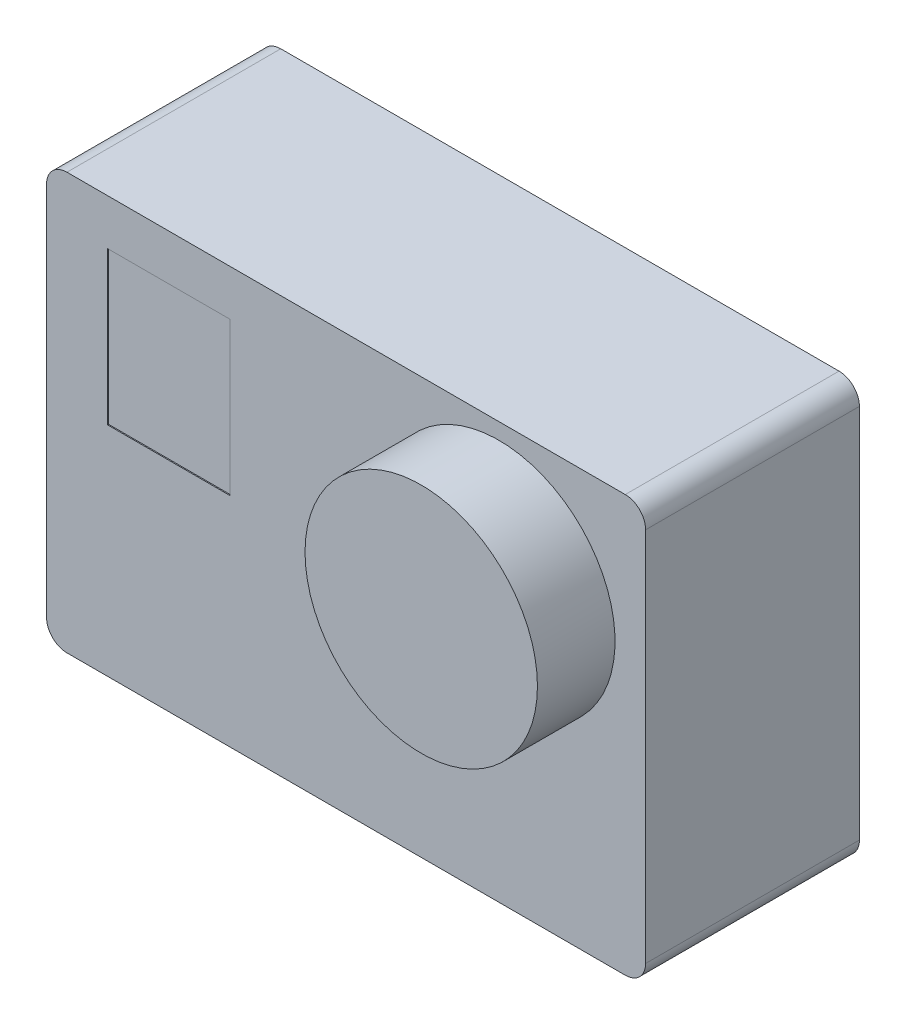
ISO-10303-21;
HEADER;
FILE_DESCRIPTION(('STEP AP214'),'2;1');
FILE_NAME('part.step','',(''),(''),'','','');
FILE_SCHEMA(('AUTOMOTIVE_DESIGN { 1 0 10303 214 1 1 1 1 }'));
ENDSEC;
DATA;
#1=APPLICATION_CONTEXT('core data for automotive mechanical design processes');
#2=APPLICATION_PROTOCOL_DEFINITION('international standard','automotive_design',2000,#1);
#3=PRODUCT_CONTEXT('',#1,'mechanical');
#4=PRODUCT('Part','Part','',(#3));
#5=PRODUCT_RELATED_PRODUCT_CATEGORY('part','',(#4));
#6=PRODUCT_DEFINITION_FORMATION('','',#4);
#7=PRODUCT_DEFINITION_CONTEXT('part definition',#1,'design');
#8=PRODUCT_DEFINITION('design','',#6,#7);
#9=PRODUCT_DEFINITION_SHAPE('','',#8);
#10=(LENGTH_UNIT() NAMED_UNIT(*) SI_UNIT(.MILLI.,.METRE.));
#11=(NAMED_UNIT(*) PLANE_ANGLE_UNIT() SI_UNIT($,.RADIAN.));
#12=(NAMED_UNIT(*) SI_UNIT($,.STERADIAN.) SOLID_ANGLE_UNIT());
#13=UNCERTAINTY_MEASURE_WITH_UNIT(LENGTH_MEASURE(1.E-05),#10,'distance_accuracy_value','');
#14=(GEOMETRIC_REPRESENTATION_CONTEXT(3) GLOBAL_UNCERTAINTY_ASSIGNED_CONTEXT((#13)) GLOBAL_UNIT_ASSIGNED_CONTEXT((#10,
#11,#12)) REPRESENTATION_CONTEXT('',''));
#15=CARTESIAN_POINT('',(0.,0.,0.));
#16=DIRECTION('',(0.,0.,1.));
#17=DIRECTION('',(1.,0.,0.));
#18=AXIS2_PLACEMENT_3D('',#15,#16,#17);
#19=CARTESIAN_POINT('',(29.42,-20.445,10.5));
#20=DIRECTION('',(-1.,0.,0.));
#21=DIRECTION('',(0.,0.,1.));
#22=AXIS2_PLACEMENT_3D('',#19,#20,#21);
#23=PLANE('',#22);
#24=DIRECTION('',(0.,1.,0.));
#25=VECTOR('',#24,1.);
#26=CARTESIAN_POINT('',(29.42,-20.445,10.5));
#27=LINE('',#26,#25);
#28=CARTESIAN_POINT('',(29.42,-18.445,10.5));
#29=VERTEX_POINT('',#28);
#30=CARTESIAN_POINT('',(29.42,18.445,10.5));
#31=VERTEX_POINT('',#30);
#32=EDGE_CURVE('E196',#29,#31,#27,.T.);
#33=ORIENTED_EDGE('',*,*,#32,.F.);
#34=DIRECTION('',(0.,0.,-1.));
#35=VECTOR('',#34,1.);
#36=CARTESIAN_POINT('',(29.42,-18.445,10.5));
#37=LINE('',#36,#35);
#38=CARTESIAN_POINT('',(29.42,-18.445,-10.5));
#39=VERTEX_POINT('',#38);
#40=EDGE_CURVE('E231',#29,#39,#37,.T.);
#41=ORIENTED_EDGE('',*,*,#40,.T.);
#42=DIRECTION('',(0.,1.,0.));
#43=VECTOR('',#42,1.);
#44=CARTESIAN_POINT('',(29.42,-20.445,-10.5));
#45=LINE('',#44,#43);
#46=CARTESIAN_POINT('',(29.42,18.445,-10.5));
#47=VERTEX_POINT('',#46);
#48=EDGE_CURVE('E195',#39,#47,#45,.T.);
#49=ORIENTED_EDGE('',*,*,#48,.T.);
#50=DIRECTION('',(0.,0.,-1.));
#51=VECTOR('',#50,1.);
#52=CARTESIAN_POINT('',(29.42,18.445,10.5));
#53=LINE('',#52,#51);
#54=EDGE_CURVE('E228',#47,#31,#53,.F.);
#55=ORIENTED_EDGE('',*,*,#54,.T.);
#56=EDGE_LOOP('',(#33,#41,#49,#55));
#57=FACE_BOUND('',#56,.T.);
#58=ADVANCED_FACE('F46',(#57),#23,.F.);
#59=CARTESIAN_POINT('',(-29.42,20.445,10.5));
#60=DIRECTION('',(0.,-1.,0.));
#61=DIRECTION('',(0.,0.,-1.));
#62=AXIS2_PLACEMENT_3D('',#59,#60,#61);
#63=PLANE('',#62);
#64=DIRECTION('',(-1.,0.,0.));
#65=VECTOR('',#64,1.);
#66=CARTESIAN_POINT('',(-29.42,20.445,-10.5));
#67=LINE('',#66,#65);
#68=CARTESIAN_POINT('',(27.42,20.445,-10.5));
#69=VERTEX_POINT('',#68);
#70=CARTESIAN_POINT('',(-27.42,20.445,-10.5));
#71=VERTEX_POINT('',#70);
#72=EDGE_CURVE('E215',#69,#71,#67,.T.);
#73=ORIENTED_EDGE('',*,*,#72,.T.);
#74=DIRECTION('',(0.,0.,-1.));
#75=VECTOR('',#74,1.);
#76=CARTESIAN_POINT('',(-27.42,20.445,10.5));
#77=LINE('',#76,#75);
#78=CARTESIAN_POINT('',(-27.42,20.445,10.5));
#79=VERTEX_POINT('',#78);
#80=EDGE_CURVE('E11',#71,#79,#77,.F.);
#81=ORIENTED_EDGE('',*,*,#80,.T.);
#82=DIRECTION('',(-1.,0.,0.));
#83=VECTOR('',#82,1.);
#84=CARTESIAN_POINT('',(-29.42,20.445,10.5));
#85=LINE('',#84,#83);
#86=CARTESIAN_POINT('',(27.42,20.445,10.5));
#87=VERTEX_POINT('',#86);
#88=EDGE_CURVE('E200',#87,#79,#85,.T.);
#89=ORIENTED_EDGE('',*,*,#88,.F.);
#90=DIRECTION('',(0.,0.,-1.));
#91=VECTOR('',#90,1.);
#92=CARTESIAN_POINT('',(27.42,20.445,10.5));
#93=LINE('',#92,#91);
#94=EDGE_CURVE('E55',#87,#69,#93,.T.);
#95=ORIENTED_EDGE('',*,*,#94,.T.);
#96=EDGE_LOOP('',(#73,#81,#89,#95));
#97=FACE_BOUND('',#96,.T.);
#98=ADVANCED_FACE('F276',(#97),#63,.F.);
#99=CARTESIAN_POINT('',(-29.42,-20.445,10.5));
#100=DIRECTION('',(1.,0.,0.));
#101=DIRECTION('',(0.,0.,-1.));
#102=AXIS2_PLACEMENT_3D('',#99,#100,#101);
#103=PLANE('',#102);
#104=DIRECTION('',(0.,-1.,0.));
#105=VECTOR('',#104,1.);
#106=CARTESIAN_POINT('',(-29.42,-20.445,-10.5));
#107=LINE('',#106,#105);
#108=CARTESIAN_POINT('',(-29.42,18.445,-10.5));
#109=VERTEX_POINT('',#108);
#110=CARTESIAN_POINT('',(-29.42,-18.445,-10.5));
#111=VERTEX_POINT('',#110);
#112=EDGE_CURVE('E219',#109,#111,#107,.T.);
#113=ORIENTED_EDGE('',*,*,#112,.T.);
#114=DIRECTION('',(0.,0.,-1.));
#115=VECTOR('',#114,1.);
#116=CARTESIAN_POINT('',(-29.42,-18.445,10.5));
#117=LINE('',#116,#115);
#118=CARTESIAN_POINT('',(-29.42,-18.445,10.5));
#119=VERTEX_POINT('',#118);
#120=EDGE_CURVE('E62',#111,#119,#117,.F.);
#121=ORIENTED_EDGE('',*,*,#120,.T.);
#122=DIRECTION('',(0.,-1.,0.));
#123=VECTOR('',#122,1.);
#124=CARTESIAN_POINT('',(-29.42,-20.445,10.5));
#125=LINE('',#124,#123);
#126=CARTESIAN_POINT('',(-29.42,18.445,10.5));
#127=VERTEX_POINT('',#126);
#128=EDGE_CURVE('E204',#127,#119,#125,.T.);
#129=ORIENTED_EDGE('',*,*,#128,.F.);
#130=DIRECTION('',(0.,0.,-1.));
#131=VECTOR('',#130,1.);
#132=CARTESIAN_POINT('',(-29.42,18.445,10.5));
#133=LINE('',#132,#131);
#134=EDGE_CURVE('E265',#127,#109,#133,.T.);
#135=ORIENTED_EDGE('',*,*,#134,.T.);
#136=EDGE_LOOP('',(#113,#121,#129,#135));
#137=FACE_BOUND('',#136,.T.);
#138=ADVANCED_FACE('F287',(#137),#103,.F.);
#139=CARTESIAN_POINT('',(-29.42,-20.445,10.5));
#140=DIRECTION('',(0.,1.,0.));
#141=DIRECTION('',(0.,0.,1.));
#142=AXIS2_PLACEMENT_3D('',#139,#140,#141);
#143=PLANE('',#142);
#144=DIRECTION('',(1.,0.,0.));
#145=VECTOR('',#144,1.);
#146=CARTESIAN_POINT('',(-29.42,-20.445,-10.5));
#147=LINE('',#146,#145);
#148=CARTESIAN_POINT('',(-27.42,-20.445,-10.5));
#149=VERTEX_POINT('',#148);
#150=CARTESIAN_POINT('',(27.42,-20.445,-10.5));
#151=VERTEX_POINT('',#150);
#152=EDGE_CURVE('E201',#149,#151,#147,.T.);
#153=ORIENTED_EDGE('',*,*,#152,.T.);
#154=DIRECTION('',(0.,0.,-1.));
#155=VECTOR('',#154,1.);
#156=CARTESIAN_POINT('',(27.42,-20.445,10.5));
#157=LINE('',#156,#155);
#158=CARTESIAN_POINT('',(27.42,-20.445,10.5));
#159=VERTEX_POINT('',#158);
#160=EDGE_CURVE('E251',#151,#159,#157,.F.);
#161=ORIENTED_EDGE('',*,*,#160,.T.);
#162=DIRECTION('',(1.,0.,0.));
#163=VECTOR('',#162,1.);
#164=CARTESIAN_POINT('',(-29.42,-20.445,10.5));
#165=LINE('',#164,#163);
#166=CARTESIAN_POINT('',(-27.42,-20.445,10.5));
#167=VERTEX_POINT('',#166);
#168=EDGE_CURVE('E207',#167,#159,#165,.T.);
#169=ORIENTED_EDGE('',*,*,#168,.F.);
#170=DIRECTION('',(0.,0.,-1.));
#171=VECTOR('',#170,1.);
#172=CARTESIAN_POINT('',(-27.42,-20.445,10.5));
#173=LINE('',#172,#171);
#174=EDGE_CURVE('E247',#167,#149,#173,.T.);
#175=ORIENTED_EDGE('',*,*,#174,.T.);
#176=EDGE_LOOP('',(#153,#161,#169,#175));
#177=FACE_BOUND('',#176,.T.);
#178=ADVANCED_FACE('F296',(#177),#143,.F.);
#179=CARTESIAN_POINT('',(0.,0.,10.5));
#180=DIRECTION('',(0.,0.,-1.));
#181=DIRECTION('',(-1.,0.,0.));
#182=AXIS2_PLACEMENT_3D('',#179,#180,#181);
#183=PLANE('',#182);
#184=DIRECTION('',(1.,0.,0.));
#185=VECTOR('',#184,1.);
#186=CARTESIAN_POINT('',(-11.42,0.944999999999996,10.5));
#187=LINE('',#186,#185);
#188=CARTESIAN_POINT('',(-23.42,0.944999999999995,10.5));
#189=VERTEX_POINT('',#188);
#190=CARTESIAN_POINT('',(-11.42,0.944999999999996,10.5));
#191=VERTEX_POINT('',#190);
#192=EDGE_CURVE('E177',#189,#191,#187,.T.);
#193=ORIENTED_EDGE('',*,*,#192,.F.);
#194=DIRECTION('',(0.,-1.,0.));
#195=VECTOR('',#194,1.);
#196=CARTESIAN_POINT('',(-23.42,0.944999999999995,10.5));
#197=LINE('',#196,#195);
#198=CARTESIAN_POINT('',(-23.42,15.945,10.5));
#199=VERTEX_POINT('',#198);
#200=EDGE_CURVE('E144',#199,#189,#197,.T.);
#201=ORIENTED_EDGE('',*,*,#200,.F.);
#202=DIRECTION('',(-1.,0.,0.));
#203=VECTOR('',#202,1.);
#204=CARTESIAN_POINT('',(-11.42,15.945,10.5));
#205=LINE('',#204,#203);
#206=CARTESIAN_POINT('',(-11.42,15.945,10.5));
#207=VERTEX_POINT('',#206);
#208=EDGE_CURVE('E164',#207,#199,#205,.T.);
#209=ORIENTED_EDGE('',*,*,#208,.F.);
#210=DIRECTION('',(0.,1.,0.));
#211=VECTOR('',#210,1.);
#212=CARTESIAN_POINT('',(-11.42,0.944999999999996,10.5));
#213=LINE('',#212,#211);
#214=EDGE_CURVE('E168',#191,#207,#213,.T.);
#215=ORIENTED_EDGE('',*,*,#214,.F.);
#216=EDGE_LOOP('',(#193,#201,#209,#215));
#217=FACE_BOUND('',#216,.T.);
#218=CARTESIAN_POINT('',(15.,7.44499999999999,10.5));
#219=DIRECTION('',(0.,0.,-1.));
#220=DIRECTION('',(-1.,0.,0.));
#221=AXIS2_PLACEMENT_3D('',#218,#219,#220);
#222=CIRCLE('',#221,11.415);
#223=CARTESIAN_POINT('',(3.585,7.44499999999999,10.5));
#224=VERTEX_POINT('',#223);
#225=EDGE_CURVE('E211',#224,#224,#222,.F.);
#226=ORIENTED_EDGE('',*,*,#225,.F.);
#227=EDGE_LOOP('',(#226));
#228=FACE_BOUND('',#227,.T.);
#229=ORIENTED_EDGE('',*,*,#168,.T.);
#230=CARTESIAN_POINT('',(27.42,-18.445,10.5));
#231=DIRECTION('',(0.,0.,-1.));
#232=DIRECTION('',(-1.,0.,0.));
#233=AXIS2_PLACEMENT_3D('',#230,#231,#232);
#234=CIRCLE('',#233,2.);
#235=EDGE_CURVE('E262',#159,#29,#234,.F.);
#236=ORIENTED_EDGE('',*,*,#235,.T.);
#237=ORIENTED_EDGE('',*,*,#32,.T.);
#238=CARTESIAN_POINT('',(27.42,18.445,10.5));
#239=DIRECTION('',(0.,0.,-1.));
#240=DIRECTION('',(-1.,0.,0.));
#241=AXIS2_PLACEMENT_3D('',#238,#239,#240);
#242=CIRCLE('',#241,2.);
#243=EDGE_CURVE('E254',#31,#87,#242,.F.);
#244=ORIENTED_EDGE('',*,*,#243,.T.);
#245=ORIENTED_EDGE('',*,*,#88,.T.);
#246=CARTESIAN_POINT('',(-27.42,18.445,10.5));
#247=DIRECTION('',(0.,0.,-1.));
#248=DIRECTION('',(-1.,0.,0.));
#249=AXIS2_PLACEMENT_3D('',#246,#247,#248);
#250=CIRCLE('',#249,2.);
#251=EDGE_CURVE('E69',#79,#127,#250,.F.);
#252=ORIENTED_EDGE('',*,*,#251,.T.);
#253=ORIENTED_EDGE('',*,*,#128,.T.);
#254=CARTESIAN_POINT('',(-27.42,-18.445,10.5));
#255=DIRECTION('',(0.,0.,-1.));
#256=DIRECTION('',(-1.,0.,0.));
#257=AXIS2_PLACEMENT_3D('',#254,#255,#256);
#258=CIRCLE('',#257,2.);
#259=EDGE_CURVE('E259',#119,#167,#258,.F.);
#260=ORIENTED_EDGE('',*,*,#259,.T.);
#261=EDGE_LOOP('',(#229,#236,#237,#244,#245,#252,#253,#260));
#262=FACE_BOUND('',#261,.T.);
#263=ADVANCED_FACE('F289',(#217,#228,#262),#183,.F.);
#264=CARTESIAN_POINT('',(0.,0.,-10.5));
#265=DIRECTION('',(0.,0.,-1.));
#266=DIRECTION('',(-1.,0.,0.));
#267=AXIS2_PLACEMENT_3D('',#264,#265,#266);
#268=PLANE('',#267);
#269=ORIENTED_EDGE('',*,*,#48,.F.);
#270=CARTESIAN_POINT('',(27.42,-18.445,-10.5));
#271=DIRECTION('',(0.,0.,-1.));
#272=DIRECTION('',(-1.,0.,0.));
#273=AXIS2_PLACEMENT_3D('',#270,#271,#272);
#274=CIRCLE('',#273,2.);
#275=EDGE_CURVE('E244',#39,#151,#274,.T.);
#276=ORIENTED_EDGE('',*,*,#275,.T.);
#277=ORIENTED_EDGE('',*,*,#152,.F.);
#278=CARTESIAN_POINT('',(-27.42,-18.445,-10.5));
#279=DIRECTION('',(0.,0.,-1.));
#280=DIRECTION('',(-1.,0.,0.));
#281=AXIS2_PLACEMENT_3D('',#278,#279,#280);
#282=CIRCLE('',#281,2.);
#283=EDGE_CURVE('E241',#149,#111,#282,.T.);
#284=ORIENTED_EDGE('',*,*,#283,.T.);
#285=ORIENTED_EDGE('',*,*,#112,.F.);
#286=CARTESIAN_POINT('',(-27.42,18.445,-10.5));
#287=DIRECTION('',(0.,0.,-1.));
#288=DIRECTION('',(-1.,0.,0.));
#289=AXIS2_PLACEMENT_3D('',#286,#287,#288);
#290=CIRCLE('',#289,2.);
#291=EDGE_CURVE('E238',#109,#71,#290,.T.);
#292=ORIENTED_EDGE('',*,*,#291,.T.);
#293=ORIENTED_EDGE('',*,*,#72,.F.);
#294=CARTESIAN_POINT('',(27.42,18.445,-10.5));
#295=DIRECTION('',(0.,0.,-1.));
#296=DIRECTION('',(-1.,0.,0.));
#297=AXIS2_PLACEMENT_3D('',#294,#295,#296);
#298=CIRCLE('',#297,2.);
#299=EDGE_CURVE('E235',#69,#47,#298,.T.);
#300=ORIENTED_EDGE('',*,*,#299,.T.);
#301=EDGE_LOOP('',(#269,#276,#277,#284,#285,#292,#293,#300));
#302=FACE_BOUND('',#301,.T.);
#303=ADVANCED_FACE('F282',(#302),#268,.T.);
#304=CARTESIAN_POINT('',(15.,7.44499999999999,18.12));
#305=DIRECTION('',(0.,0.,-1.));
#306=DIRECTION('',(-1.,0.,0.));
#307=AXIS2_PLACEMENT_3D('',#304,#305,#306);
#308=CYLINDRICAL_SURFACE('',#307,11.415);
#309=CARTESIAN_POINT('',(15.,7.44499999999999,18.12));
#310=DIRECTION('',(0.,0.,1.));
#311=DIRECTION('',(1.,0.,0.));
#312=AXIS2_PLACEMENT_3D('',#309,#310,#311);
#313=CIRCLE('',#312,11.415);
#314=CARTESIAN_POINT('',(26.415,7.44499999999999,18.12));
#315=VERTEX_POINT('',#314);
#316=EDGE_CURVE('E186',#315,#315,#313,.T.);
#317=ORIENTED_EDGE('',*,*,#316,.F.);
#318=EDGE_LOOP('',(#317));
#319=FACE_BOUND('',#318,.T.);
#320=ORIENTED_EDGE('',*,*,#225,.T.);
#321=EDGE_LOOP('',(#320));
#322=FACE_BOUND('',#321,.T.);
#323=ADVANCED_FACE('F420',(#319,#322),#308,.T.);
#324=CARTESIAN_POINT('',(15.,7.44499999999999,18.12));
#325=DIRECTION('',(0.,0.,1.));
#326=DIRECTION('',(1.,0.,0.));
#327=AXIS2_PLACEMENT_3D('',#324,#325,#326);
#328=PLANE('',#327);
#329=ORIENTED_EDGE('',*,*,#316,.T.);
#330=EDGE_LOOP('',(#329));
#331=FACE_BOUND('',#330,.T.);
#332=ADVANCED_FACE('F409',(#331),#328,.T.);
#333=CARTESIAN_POINT('',(-23.42,0.944999999999995,10.4));
#334=DIRECTION('',(-1.,0.,0.));
#335=DIRECTION('',(0.,0.,1.));
#336=AXIS2_PLACEMENT_3D('',#333,#334,#335);
#337=PLANE('',#336);
#338=ORIENTED_EDGE('',*,*,#200,.T.);
#339=DIRECTION('',(0.,0.,1.));
#340=VECTOR('',#339,1.);
#341=CARTESIAN_POINT('',(-23.42,0.944999999999995,10.4));
#342=LINE('',#341,#340);
#343=CARTESIAN_POINT('',(-23.42,0.944999999999995,10.4));
#344=VERTEX_POINT('',#343);
#345=EDGE_CURVE('E137',#344,#189,#342,.T.);
#346=ORIENTED_EDGE('',*,*,#345,.F.);
#347=DIRECTION('',(0.,-1.,0.));
#348=VECTOR('',#347,1.);
#349=CARTESIAN_POINT('',(-23.42,0.944999999999995,10.4));
#350=LINE('',#349,#348);
#351=CARTESIAN_POINT('',(-23.42,15.945,10.4));
#352=VERTEX_POINT('',#351);
#353=EDGE_CURVE('E141',#352,#344,#350,.T.);
#354=ORIENTED_EDGE('',*,*,#353,.F.);
#355=DIRECTION('',(0.,0.,1.));
#356=VECTOR('',#355,1.);
#357=CARTESIAN_POINT('',(-23.42,15.945,10.4));
#358=LINE('',#357,#356);
#359=EDGE_CURVE('E183',#352,#199,#358,.T.);
#360=ORIENTED_EDGE('',*,*,#359,.T.);
#361=EDGE_LOOP('',(#338,#346,#354,#360));
#362=FACE_BOUND('',#361,.T.);
#363=ADVANCED_FACE('F139',(#362),#337,.F.);
#364=CARTESIAN_POINT('',(-11.42,15.945,10.4));
#365=DIRECTION('',(0.,1.,0.));
#366=DIRECTION('',(-1.,0.,0.));
#367=AXIS2_PLACEMENT_3D('',#364,#365,#366);
#368=PLANE('',#367);
#369=ORIENTED_EDGE('',*,*,#208,.T.);
#370=ORIENTED_EDGE('',*,*,#359,.F.);
#371=DIRECTION('',(-1.,0.,0.));
#372=VECTOR('',#371,1.);
#373=CARTESIAN_POINT('',(-11.42,15.945,10.4));
#374=LINE('',#373,#372);
#375=CARTESIAN_POINT('',(-11.42,15.945,10.4));
#376=VERTEX_POINT('',#375);
#377=EDGE_CURVE('E150',#376,#352,#374,.T.);
#378=ORIENTED_EDGE('',*,*,#377,.F.);
#379=DIRECTION('',(0.,0.,1.));
#380=VECTOR('',#379,1.);
#381=CARTESIAN_POINT('',(-11.42,15.945,10.4));
#382=LINE('',#381,#380);
#383=EDGE_CURVE('E187',#376,#207,#382,.T.);
#384=ORIENTED_EDGE('',*,*,#383,.T.);
#385=EDGE_LOOP('',(#369,#370,#378,#384));
#386=FACE_BOUND('',#385,.T.);
#387=ADVANCED_FACE('F386',(#386),#368,.F.);
#388=CARTESIAN_POINT('',(-11.42,0.944999999999996,10.4));
#389=DIRECTION('',(1.,0.,0.));
#390=DIRECTION('',(0.,0.,-1.));
#391=AXIS2_PLACEMENT_3D('',#388,#389,#390);
#392=PLANE('',#391);
#393=ORIENTED_EDGE('',*,*,#214,.T.);
#394=ORIENTED_EDGE('',*,*,#383,.F.);
#395=DIRECTION('',(0.,1.,0.));
#396=VECTOR('',#395,1.);
#397=CARTESIAN_POINT('',(-11.42,0.944999999999996,10.4));
#398=LINE('',#397,#396);
#399=CARTESIAN_POINT('',(-11.42,0.944999999999996,10.4));
#400=VERTEX_POINT('',#399);
#401=EDGE_CURVE('E159',#400,#376,#398,.T.);
#402=ORIENTED_EDGE('',*,*,#401,.F.);
#403=DIRECTION('',(0.,0.,1.));
#404=VECTOR('',#403,1.);
#405=CARTESIAN_POINT('',(-11.42,0.944999999999996,10.4));
#406=LINE('',#405,#404);
#407=EDGE_CURVE('E149',#400,#191,#406,.T.);
#408=ORIENTED_EDGE('',*,*,#407,.T.);
#409=EDGE_LOOP('',(#393,#394,#402,#408));
#410=FACE_BOUND('',#409,.T.);
#411=ADVANCED_FACE('F375',(#410),#392,.F.);
#412=CARTESIAN_POINT('',(-11.42,0.944999999999996,10.4));
#413=DIRECTION('',(0.,-1.,0.));
#414=DIRECTION('',(1.,0.,0.));
#415=AXIS2_PLACEMENT_3D('',#412,#413,#414);
#416=PLANE('',#415);
#417=ORIENTED_EDGE('',*,*,#192,.T.);
#418=ORIENTED_EDGE('',*,*,#407,.F.);
#419=DIRECTION('',(1.,0.,0.));
#420=VECTOR('',#419,1.);
#421=CARTESIAN_POINT('',(-11.42,0.944999999999996,10.4));
#422=LINE('',#421,#420);
#423=EDGE_CURVE('E153',#344,#400,#422,.T.);
#424=ORIENTED_EDGE('',*,*,#423,.F.);
#425=ORIENTED_EDGE('',*,*,#345,.T.);
#426=EDGE_LOOP('',(#417,#418,#424,#425));
#427=FACE_BOUND('',#426,.T.);
#428=ADVANCED_FACE('F154',(#427),#416,.F.);
#429=CARTESIAN_POINT('',(0.,0.,10.4));
#430=DIRECTION('',(0.,0.,1.));
#431=DIRECTION('',(1.,0.,0.));
#432=AXIS2_PLACEMENT_3D('',#429,#430,#431);
#433=PLANE('',#432);
#434=ORIENTED_EDGE('',*,*,#353,.T.);
#435=ORIENTED_EDGE('',*,*,#423,.T.);
#436=ORIENTED_EDGE('',*,*,#401,.T.);
#437=ORIENTED_EDGE('',*,*,#377,.T.);
#438=EDGE_LOOP('',(#434,#435,#436,#437));
#439=FACE_BOUND('',#438,.T.);
#440=ADVANCED_FACE('F161',(#439),#433,.T.);
#441=CARTESIAN_POINT('',(27.42,-18.445,10.5));
#442=DIRECTION('',(0.,0.,-1.));
#443=DIRECTION('',(-1.,0.,0.));
#444=AXIS2_PLACEMENT_3D('',#441,#442,#443);
#445=CYLINDRICAL_SURFACE('',#444,2.);
#446=ORIENTED_EDGE('',*,*,#235,.F.);
#447=ORIENTED_EDGE('',*,*,#160,.F.);
#448=ORIENTED_EDGE('',*,*,#275,.F.);
#449=ORIENTED_EDGE('',*,*,#40,.F.);
#450=EDGE_LOOP('',(#446,#447,#448,#449));
#451=FACE_BOUND('',#450,.T.);
#452=ADVANCED_FACE('F301',(#451),#445,.T.);
#453=CARTESIAN_POINT('',(-27.42,-18.445,10.5));
#454=DIRECTION('',(0.,0.,-1.));
#455=DIRECTION('',(-1.,0.,0.));
#456=AXIS2_PLACEMENT_3D('',#453,#454,#455);
#457=CYLINDRICAL_SURFACE('',#456,2.);
#458=ORIENTED_EDGE('',*,*,#259,.F.);
#459=ORIENTED_EDGE('',*,*,#120,.F.);
#460=ORIENTED_EDGE('',*,*,#283,.F.);
#461=ORIENTED_EDGE('',*,*,#174,.F.);
#462=EDGE_LOOP('',(#458,#459,#460,#461));
#463=FACE_BOUND('',#462,.T.);
#464=ADVANCED_FACE('F293',(#463),#457,.T.);
#465=CARTESIAN_POINT('',(-27.42,18.445,10.5));
#466=DIRECTION('',(0.,0.,-1.));
#467=DIRECTION('',(-1.,0.,0.));
#468=AXIS2_PLACEMENT_3D('',#465,#466,#467);
#469=CYLINDRICAL_SURFACE('',#468,2.);
#470=ORIENTED_EDGE('',*,*,#251,.F.);
#471=ORIENTED_EDGE('',*,*,#80,.F.);
#472=ORIENTED_EDGE('',*,*,#291,.F.);
#473=ORIENTED_EDGE('',*,*,#134,.F.);
#474=EDGE_LOOP('',(#470,#471,#472,#473));
#475=FACE_BOUND('',#474,.T.);
#476=ADVANCED_FACE('F286',(#475),#469,.T.);
#477=CARTESIAN_POINT('',(27.42,18.445,10.5));
#478=DIRECTION('',(0.,0.,-1.));
#479=DIRECTION('',(-1.,0.,0.));
#480=AXIS2_PLACEMENT_3D('',#477,#478,#479);
#481=CYLINDRICAL_SURFACE('',#480,2.);
#482=ORIENTED_EDGE('',*,*,#243,.F.);
#483=ORIENTED_EDGE('',*,*,#54,.F.);
#484=ORIENTED_EDGE('',*,*,#299,.F.);
#485=ORIENTED_EDGE('',*,*,#94,.F.);
#486=EDGE_LOOP('',(#482,#483,#484,#485));
#487=FACE_BOUND('',#486,.T.);
#488=ADVANCED_FACE('F48',(#487),#481,.T.);
#489=CLOSED_SHELL('',(#58,#98,#138,#178,#263,#303,#323,#332,#363,#387,#411,#428,#440,#452,#464,
#476,#488));
#490=MANIFOLD_SOLID_BREP('B2',#489);
#491=ADVANCED_BREP_SHAPE_REPRESENTATION('',(#18,#490),#14);
#492=SHAPE_DEFINITION_REPRESENTATION(#9,#491);
ENDSEC;
END-ISO-10303-21;
